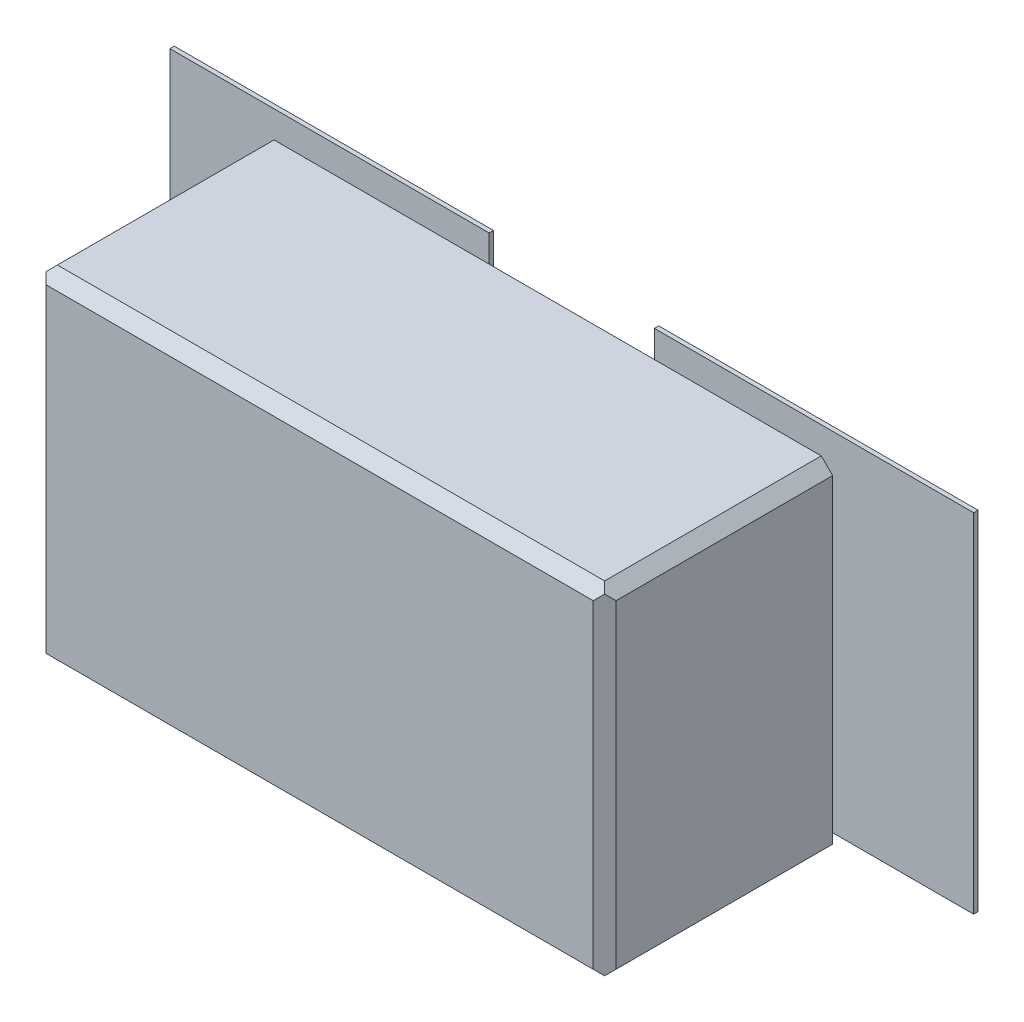
ISO-10303-21;
HEADER;
FILE_DESCRIPTION(('STEP AP214'),'2;1');
FILE_NAME('part.step','',(''),(''),'','','');
FILE_SCHEMA(('AUTOMOTIVE_DESIGN { 1 0 10303 214 1 1 1 1 }'));
ENDSEC;
DATA;
#1=APPLICATION_CONTEXT('core data for automotive mechanical design processes');
#2=APPLICATION_PROTOCOL_DEFINITION('international standard','automotive_design',2000,#1);
#3=PRODUCT_CONTEXT('',#1,'mechanical');
#4=PRODUCT('Part','Part','',(#3));
#5=PRODUCT_RELATED_PRODUCT_CATEGORY('part','',(#4));
#6=PRODUCT_DEFINITION_FORMATION('','',#4);
#7=PRODUCT_DEFINITION_CONTEXT('part definition',#1,'design');
#8=PRODUCT_DEFINITION('design','',#6,#7);
#9=PRODUCT_DEFINITION_SHAPE('','',#8);
#10=(LENGTH_UNIT() NAMED_UNIT(*) SI_UNIT(.MILLI.,.METRE.));
#11=(NAMED_UNIT(*) PLANE_ANGLE_UNIT() SI_UNIT($,.RADIAN.));
#12=(NAMED_UNIT(*) SI_UNIT($,.STERADIAN.) SOLID_ANGLE_UNIT());
#13=UNCERTAINTY_MEASURE_WITH_UNIT(LENGTH_MEASURE(1.E-05),#10,'distance_accuracy_value','');
#14=(GEOMETRIC_REPRESENTATION_CONTEXT(3) GLOBAL_UNCERTAINTY_ASSIGNED_CONTEXT((#13)) GLOBAL_UNIT_ASSIGNED_CONTEXT((#10,
#11,#12)) REPRESENTATION_CONTEXT('',''));
#15=CARTESIAN_POINT('',(0.,0.,0.));
#16=DIRECTION('',(0.,0.,1.));
#17=DIRECTION('',(1.,0.,0.));
#18=AXIS2_PLACEMENT_3D('',#15,#16,#17);
#19=CARTESIAN_POINT('',(-0.49,0.,0.5162));
#20=DIRECTION('',(-0.707106781186548,0.,0.707106781186548));
#21=DIRECTION('',(0.,1.,0.));
#22=AXIS2_PLACEMENT_3D('',#19,#20,#21);
#23=PLANE('',#22);
#24=DIRECTION('',(0.,-1.,0.));
#25=VECTOR('',#24,1.);
#26=CARTESIAN_POINT('',(-0.5,0.28,0.5062));
#27=LINE('',#26,#25);
#28=CARTESIAN_POINT('',(-0.5,0.28,0.5062));
#29=VERTEX_POINT('',#28);
#30=CARTESIAN_POINT('',(-0.5,-0.28,0.5062));
#31=VERTEX_POINT('',#30);
#32=EDGE_CURVE('P0_E265',#29,#31,#27,.T.);
#33=ORIENTED_EDGE('',*,*,#32,.T.);
#34=DIRECTION('',(-0.577350269189626,0.577350269189626,-0.577350269189626));
#35=VECTOR('',#34,1.);
#36=CARTESIAN_POINT('',(-0.49,-0.29,0.5162));
#37=LINE('',#36,#35);
#38=CARTESIAN_POINT('',(-0.49,-0.29,0.5162));
#39=VERTEX_POINT('',#38);
#40=EDGE_CURVE('P0_E332',#39,#31,#37,.T.);
#41=ORIENTED_EDGE('',*,*,#40,.F.);
#42=DIRECTION('',(-0.577350269189626,-0.577350269189626,-0.577350269189626));
#43=VECTOR('',#42,1.);
#44=CARTESIAN_POINT('',(-0.48,-0.28,0.5262));
#45=LINE('',#44,#43);
#46=CARTESIAN_POINT('',(-0.48,-0.28,0.5262));
#47=VERTEX_POINT('',#46);
#48=EDGE_CURVE('P0_E11',#47,#39,#45,.T.);
#49=ORIENTED_EDGE('',*,*,#48,.F.);
#50=DIRECTION('',(0.,-1.,0.));
#51=VECTOR('',#50,1.);
#52=CARTESIAN_POINT('',(-0.48,0.28,0.5262));
#53=LINE('',#52,#51);
#54=CARTESIAN_POINT('',(-0.48,0.28,0.5262));
#55=VERTEX_POINT('',#54);
#56=EDGE_CURVE('P0_E307',#55,#47,#53,.T.);
#57=ORIENTED_EDGE('',*,*,#56,.F.);
#58=DIRECTION('',(0.577350269189626,-0.577350269189626,0.577350269189626));
#59=VECTOR('',#58,1.);
#60=CARTESIAN_POINT('',(-0.49,0.29,0.5162));
#61=LINE('',#60,#59);
#62=CARTESIAN_POINT('',(-0.49,0.29,0.5162));
#63=VERTEX_POINT('',#62);
#64=EDGE_CURVE('P0_E308',#63,#55,#61,.T.);
#65=ORIENTED_EDGE('',*,*,#64,.F.);
#66=DIRECTION('',(0.577350269189626,0.577350269189626,0.577350269189626));
#67=VECTOR('',#66,1.);
#68=CARTESIAN_POINT('',(-0.5,0.28,0.5062));
#69=LINE('',#68,#67);
#70=EDGE_CURVE('P0_E264',#29,#63,#69,.T.);
#71=ORIENTED_EDGE('',*,*,#70,.F.);
#72=EDGE_LOOP('',(#33,#41,#49,#57,#65,#71));
#73=FACE_BOUND('',#72,.T.);
#74=ADVANCED_FACE('P0_F16',(#73),#23,.T.);
#75=CARTESIAN_POINT('',(0.,-0.29,0.5162));
#76=DIRECTION('',(0.,-0.707106781186548,0.707106781186548));
#77=DIRECTION('',(-1.,0.,0.));
#78=AXIS2_PLACEMENT_3D('',#75,#76,#77);
#79=PLANE('',#78);
#80=DIRECTION('',(1.,0.,0.));
#81=VECTOR('',#80,1.);
#82=CARTESIAN_POINT('',(-0.48,-0.3,0.5062));
#83=LINE('',#82,#81);
#84=CARTESIAN_POINT('',(-0.48,-0.3,0.5062));
#85=VERTEX_POINT('',#84);
#86=CARTESIAN_POINT('',(0.48,-0.3,0.5062));
#87=VERTEX_POINT('',#86);
#88=EDGE_CURVE('P0_E254',#85,#87,#83,.T.);
#89=ORIENTED_EDGE('',*,*,#88,.T.);
#90=DIRECTION('',(-0.577350269189626,-0.577350269189626,-0.577350269189626));
#91=VECTOR('',#90,1.);
#92=CARTESIAN_POINT('',(0.49,-0.29,0.5162));
#93=LINE('',#92,#91);
#94=CARTESIAN_POINT('',(0.49,-0.29,0.5162));
#95=VERTEX_POINT('',#94);
#96=EDGE_CURVE('P0_E220',#95,#87,#93,.T.);
#97=ORIENTED_EDGE('',*,*,#96,.F.);
#98=DIRECTION('',(0.577350269189626,-0.577350269189626,-0.577350269189626));
#99=VECTOR('',#98,1.);
#100=CARTESIAN_POINT('',(0.48,-0.28,0.5262));
#101=LINE('',#100,#99);
#102=CARTESIAN_POINT('',(0.48,-0.28,0.5262));
#103=VERTEX_POINT('',#102);
#104=EDGE_CURVE('P0_E27',#103,#95,#101,.T.);
#105=ORIENTED_EDGE('',*,*,#104,.F.);
#106=DIRECTION('',(1.,0.,0.));
#107=VECTOR('',#106,1.);
#108=CARTESIAN_POINT('',(-0.48,-0.28,0.5262));
#109=LINE('',#108,#107);
#110=EDGE_CURVE('P0_E326',#47,#103,#109,.T.);
#111=ORIENTED_EDGE('',*,*,#110,.F.);
#112=ORIENTED_EDGE('',*,*,#48,.T.);
#113=DIRECTION('',(-0.577350269189626,0.577350269189626,0.577350269189626));
#114=VECTOR('',#113,1.);
#115=CARTESIAN_POINT('',(-0.48,-0.3,0.5062));
#116=LINE('',#115,#114);
#117=EDGE_CURVE('P0_E337',#85,#39,#116,.T.);
#118=ORIENTED_EDGE('',*,*,#117,.F.);
#119=EDGE_LOOP('',(#89,#97,#105,#111,#112,#118));
#120=FACE_BOUND('',#119,.T.);
#121=ADVANCED_FACE('P0_F530',(#120),#79,.T.);
#122=CARTESIAN_POINT('',(0.49,0.,0.5162));
#123=DIRECTION('',(0.707106781186548,0.,0.707106781186548));
#124=DIRECTION('',(0.,-1.,0.));
#125=AXIS2_PLACEMENT_3D('',#122,#123,#124);
#126=PLANE('',#125);
#127=DIRECTION('',(0.,1.,0.));
#128=VECTOR('',#127,1.);
#129=CARTESIAN_POINT('',(0.5,-0.28,0.5062));
#130=LINE('',#129,#128);
#131=CARTESIAN_POINT('',(0.5,-0.28,0.5062));
#132=VERTEX_POINT('',#131);
#133=CARTESIAN_POINT('',(0.5,0.28,0.5062));
#134=VERTEX_POINT('',#133);
#135=EDGE_CURVE('P0_E213',#132,#134,#130,.T.);
#136=ORIENTED_EDGE('',*,*,#135,.T.);
#137=DIRECTION('',(0.577350269189626,-0.577350269189626,-0.577350269189626));
#138=VECTOR('',#137,1.);
#139=CARTESIAN_POINT('',(0.49,0.29,0.5162));
#140=LINE('',#139,#138);
#141=CARTESIAN_POINT('',(0.49,0.29,0.5162));
#142=VERTEX_POINT('',#141);
#143=EDGE_CURVE('P0_E241',#142,#134,#140,.T.);
#144=ORIENTED_EDGE('',*,*,#143,.F.);
#145=DIRECTION('',(0.577350269189626,0.577350269189626,-0.577350269189626));
#146=VECTOR('',#145,1.);
#147=CARTESIAN_POINT('',(0.48,0.28,0.5262));
#148=LINE('',#147,#146);
#149=CARTESIAN_POINT('',(0.48,0.28,0.5262));
#150=VERTEX_POINT('',#149);
#151=EDGE_CURVE('P0_E259',#150,#142,#148,.T.);
#152=ORIENTED_EDGE('',*,*,#151,.F.);
#153=DIRECTION('',(0.,1.,0.));
#154=VECTOR('',#153,1.);
#155=CARTESIAN_POINT('',(0.48,-0.28,0.5262));
#156=LINE('',#155,#154);
#157=EDGE_CURVE('P0_E305',#103,#150,#156,.T.);
#158=ORIENTED_EDGE('',*,*,#157,.F.);
#159=ORIENTED_EDGE('',*,*,#104,.T.);
#160=DIRECTION('',(-0.577350269189626,-0.577350269189626,0.577350269189626));
#161=VECTOR('',#160,1.);
#162=CARTESIAN_POINT('',(0.5,-0.28,0.5062));
#163=LINE('',#162,#161);
#164=EDGE_CURVE('P0_E208',#132,#95,#163,.T.);
#165=ORIENTED_EDGE('',*,*,#164,.F.);
#166=EDGE_LOOP('',(#136,#144,#152,#158,#159,#165));
#167=FACE_BOUND('',#166,.T.);
#168=ADVANCED_FACE('P0_F210',(#167),#126,.T.);
#169=CARTESIAN_POINT('',(0.,0.,0.5262));
#170=DIRECTION('',(0.,0.,1.));
#171=DIRECTION('',(1.,0.,0.));
#172=AXIS2_PLACEMENT_3D('',#169,#170,#171);
#173=PLANE('',#172);
#174=ORIENTED_EDGE('',*,*,#157,.T.);
#175=DIRECTION('',(-1.,0.,0.));
#176=VECTOR('',#175,1.);
#177=CARTESIAN_POINT('',(0.48,0.28,0.5262));
#178=LINE('',#177,#176);
#179=EDGE_CURVE('P0_E255',#150,#55,#178,.T.);
#180=ORIENTED_EDGE('',*,*,#179,.T.);
#181=ORIENTED_EDGE('',*,*,#56,.T.);
#182=ORIENTED_EDGE('',*,*,#110,.T.);
#183=EDGE_LOOP('',(#174,#180,#181,#182));
#184=FACE_BOUND('',#183,.T.);
#185=ADVANCED_FACE('P0_F487',(#184),#173,.T.);
#186=CARTESIAN_POINT('',(0.,0.29,0.5162));
#187=DIRECTION('',(0.,0.707106781186548,0.707106781186548));
#188=DIRECTION('',(1.,0.,0.));
#189=AXIS2_PLACEMENT_3D('',#186,#187,#188);
#190=PLANE('',#189);
#191=ORIENTED_EDGE('',*,*,#179,.F.);
#192=ORIENTED_EDGE('',*,*,#151,.T.);
#193=DIRECTION('',(0.577350269189626,-0.577350269189626,0.577350269189626));
#194=VECTOR('',#193,1.);
#195=CARTESIAN_POINT('',(0.48,0.3,0.5062));
#196=LINE('',#195,#194);
#197=CARTESIAN_POINT('',(0.48,0.3,0.5062));
#198=VERTEX_POINT('',#197);
#199=EDGE_CURVE('P0_E274',#198,#142,#196,.T.);
#200=ORIENTED_EDGE('',*,*,#199,.F.);
#201=DIRECTION('',(-1.,0.,0.));
#202=VECTOR('',#201,1.);
#203=CARTESIAN_POINT('',(0.48,0.3,0.5062));
#204=LINE('',#203,#202);
#205=CARTESIAN_POINT('',(-0.48,0.3,0.5062));
#206=VERTEX_POINT('',#205);
#207=EDGE_CURVE('P0_E260',#198,#206,#204,.T.);
#208=ORIENTED_EDGE('',*,*,#207,.T.);
#209=DIRECTION('',(-0.577350269189626,-0.577350269189626,0.577350269189626));
#210=VECTOR('',#209,1.);
#211=CARTESIAN_POINT('',(-0.48,0.3,0.5062));
#212=LINE('',#211,#210);
#213=EDGE_CURVE('P0_E317',#206,#63,#212,.T.);
#214=ORIENTED_EDGE('',*,*,#213,.T.);
#215=ORIENTED_EDGE('',*,*,#64,.T.);
#216=EDGE_LOOP('',(#191,#192,#200,#208,#214,#215));
#217=FACE_BOUND('',#216,.T.);
#218=ADVANCED_FACE('P0_F484',(#217),#190,.T.);
#219=CARTESIAN_POINT('',(0.5,0.3,0.0762));
#220=DIRECTION('',(0.,1.,0.));
#221=DIRECTION('',(1.,0.,0.));
#222=AXIS2_PLACEMENT_3D('',#219,#220,#221);
#223=PLANE('',#222);
#224=DIRECTION('',(0.,0.,-1.));
#225=VECTOR('',#224,1.);
#226=CARTESIAN_POINT('',(0.48,0.3,0.5062));
#227=LINE('',#226,#225);
#228=CARTESIAN_POINT('',(0.48,0.3,0.1262));
#229=VERTEX_POINT('',#228);
#230=EDGE_CURVE('P0_E271',#198,#229,#227,.T.);
#231=ORIENTED_EDGE('',*,*,#230,.T.);
#232=DIRECTION('',(-1.,0.,0.));
#233=VECTOR('',#232,1.);
#234=CARTESIAN_POINT('',(0.48,0.3,0.1262));
#235=LINE('',#234,#233);
#236=CARTESIAN_POINT('',(-0.48,0.3,0.1262));
#237=VERTEX_POINT('',#236);
#238=EDGE_CURVE('P0_E250',#229,#237,#235,.T.);
#239=ORIENTED_EDGE('',*,*,#238,.T.);
#240=DIRECTION('',(0.,0.,-1.));
#241=VECTOR('',#240,1.);
#242=CARTESIAN_POINT('',(-0.48,0.3,0.5062));
#243=LINE('',#242,#241);
#244=EDGE_CURVE('P0_E159',#206,#237,#243,.T.);
#245=ORIENTED_EDGE('',*,*,#244,.F.);
#246=ORIENTED_EDGE('',*,*,#207,.F.);
#247=EDGE_LOOP('',(#231,#239,#245,#246));
#248=FACE_BOUND('',#247,.T.);
#249=ADVANCED_FACE('P0_F655',(#248),#223,.T.);
#250=CARTESIAN_POINT('',(-0.49,0.29,0.3262));
#251=DIRECTION('',(-0.707106781186548,0.707106781186548,0.));
#252=DIRECTION('',(0.,0.,1.));
#253=AXIS2_PLACEMENT_3D('',#250,#251,#252);
#254=PLANE('',#253);
#255=DIRECTION('',(0.707106781186548,0.707106781186548,0.));
#256=VECTOR('',#255,1.);
#257=CARTESIAN_POINT('',(-0.5,0.28,0.1262));
#258=LINE('',#257,#256);
#259=CARTESIAN_POINT('',(-0.5,0.28,0.1262));
#260=VERTEX_POINT('',#259);
#261=EDGE_CURVE('P0_E266',#260,#237,#258,.T.);
#262=ORIENTED_EDGE('',*,*,#261,.F.);
#263=DIRECTION('',(0.,0.,-1.));
#264=VECTOR('',#263,1.);
#265=CARTESIAN_POINT('',(-0.5,0.28,0.5062));
#266=LINE('',#265,#264);
#267=EDGE_CURVE('P0_E261',#29,#260,#266,.T.);
#268=ORIENTED_EDGE('',*,*,#267,.F.);
#269=ORIENTED_EDGE('',*,*,#70,.T.);
#270=ORIENTED_EDGE('',*,*,#213,.F.);
#271=ORIENTED_EDGE('',*,*,#244,.T.);
#272=EDGE_LOOP('',(#262,#268,#269,#270,#271));
#273=FACE_BOUND('',#272,.T.);
#274=ADVANCED_FACE('P0_F554',(#273),#254,.T.);
#275=CARTESIAN_POINT('',(-0.5,0.3,0.0762));
#276=DIRECTION('',(-1.,0.,0.));
#277=DIRECTION('',(0.,0.,1.));
#278=AXIS2_PLACEMENT_3D('',#275,#276,#277);
#279=PLANE('',#278);
#280=DIRECTION('',(0.,0.,-1.));
#281=VECTOR('',#280,1.);
#282=CARTESIAN_POINT('',(-0.5,-0.28,0.5062));
#283=LINE('',#282,#281);
#284=CARTESIAN_POINT('',(-0.5,-0.28,0.1262));
#285=VERTEX_POINT('',#284);
#286=EDGE_CURVE('P0_E336',#31,#285,#283,.T.);
#287=ORIENTED_EDGE('',*,*,#286,.F.);
#288=ORIENTED_EDGE('',*,*,#32,.F.);
#289=ORIENTED_EDGE('',*,*,#267,.T.);
#290=DIRECTION('',(0.,-1.,0.));
#291=VECTOR('',#290,1.);
#292=CARTESIAN_POINT('',(-0.5,0.28,0.1262));
#293=LINE('',#292,#291);
#294=EDGE_CURVE('P0_E270',#260,#285,#293,.T.);
#295=ORIENTED_EDGE('',*,*,#294,.T.);
#296=EDGE_LOOP('',(#287,#288,#289,#295));
#297=FACE_BOUND('',#296,.T.);
#298=ADVANCED_FACE('P0_F551',(#297),#279,.T.);
#299=CARTESIAN_POINT('',(-0.49,-0.29,0.3262));
#300=DIRECTION('',(-0.707106781186548,-0.707106781186548,0.));
#301=DIRECTION('',(-0.707106781186548,0.707106781186548,0.));
#302=AXIS2_PLACEMENT_3D('',#299,#300,#301);
#303=PLANE('',#302);
#304=DIRECTION('',(-0.707106781186548,0.707106781186548,0.));
#305=VECTOR('',#304,1.);
#306=CARTESIAN_POINT('',(-0.48,-0.3,0.1262));
#307=LINE('',#306,#305);
#308=CARTESIAN_POINT('',(-0.48,-0.3,0.1262));
#309=VERTEX_POINT('',#308);
#310=EDGE_CURVE('P0_E301',#309,#285,#307,.T.);
#311=ORIENTED_EDGE('',*,*,#310,.F.);
#312=DIRECTION('',(0.,0.,-1.));
#313=VECTOR('',#312,1.);
#314=CARTESIAN_POINT('',(-0.48,-0.3,0.5062));
#315=LINE('',#314,#313);
#316=EDGE_CURVE('P0_E321',#85,#309,#315,.T.);
#317=ORIENTED_EDGE('',*,*,#316,.F.);
#318=ORIENTED_EDGE('',*,*,#117,.T.);
#319=ORIENTED_EDGE('',*,*,#40,.T.);
#320=ORIENTED_EDGE('',*,*,#286,.T.);
#321=EDGE_LOOP('',(#311,#317,#318,#319,#320));
#322=FACE_BOUND('',#321,.T.);
#323=ADVANCED_FACE('P0_F471',(#322),#303,.T.);
#324=CARTESIAN_POINT('',(-0.5,-0.3,0.0762));
#325=DIRECTION('',(0.,-1.,0.));
#326=DIRECTION('',(0.,0.,-1.));
#327=AXIS2_PLACEMENT_3D('',#324,#325,#326);
#328=PLANE('',#327);
#329=DIRECTION('',(0.,0.,-1.));
#330=VECTOR('',#329,1.);
#331=CARTESIAN_POINT('',(0.48,-0.3,0.5062));
#332=LINE('',#331,#330);
#333=CARTESIAN_POINT('',(0.48,-0.3,0.1262));
#334=VERTEX_POINT('',#333);
#335=EDGE_CURVE('P0_E251',#87,#334,#332,.T.);
#336=ORIENTED_EDGE('',*,*,#335,.F.);
#337=ORIENTED_EDGE('',*,*,#88,.F.);
#338=ORIENTED_EDGE('',*,*,#316,.T.);
#339=DIRECTION('',(1.,0.,0.));
#340=VECTOR('',#339,1.);
#341=CARTESIAN_POINT('',(-0.48,-0.3,0.1262));
#342=LINE('',#341,#340);
#343=EDGE_CURVE('P0_E293',#309,#334,#342,.T.);
#344=ORIENTED_EDGE('',*,*,#343,.T.);
#345=EDGE_LOOP('',(#336,#337,#338,#344));
#346=FACE_BOUND('',#345,.T.);
#347=ADVANCED_FACE('P0_F467',(#346),#328,.T.);
#348=CARTESIAN_POINT('',(0.49,-0.29,0.3262));
#349=DIRECTION('',(0.707106781186548,-0.707106781186548,0.));
#350=DIRECTION('',(0.,0.,-1.));
#351=AXIS2_PLACEMENT_3D('',#348,#349,#350);
#352=PLANE('',#351);
#353=DIRECTION('',(-0.707106781186548,-0.707106781186548,0.));
#354=VECTOR('',#353,1.);
#355=CARTESIAN_POINT('',(0.5,-0.28,0.1262));
#356=LINE('',#355,#354);
#357=CARTESIAN_POINT('',(0.5,-0.28,0.1262));
#358=VERTEX_POINT('',#357);
#359=EDGE_CURVE('P0_E226',#358,#334,#356,.T.);
#360=ORIENTED_EDGE('',*,*,#359,.F.);
#361=DIRECTION('',(0.,0.,-1.));
#362=VECTOR('',#361,1.);
#363=CARTESIAN_POINT('',(0.5,-0.28,0.5062));
#364=LINE('',#363,#362);
#365=EDGE_CURVE('P0_E221',#132,#358,#364,.T.);
#366=ORIENTED_EDGE('',*,*,#365,.F.);
#367=ORIENTED_EDGE('',*,*,#164,.T.);
#368=ORIENTED_EDGE('',*,*,#96,.T.);
#369=ORIENTED_EDGE('',*,*,#335,.T.);
#370=EDGE_LOOP('',(#360,#366,#367,#368,#369));
#371=FACE_BOUND('',#370,.T.);
#372=ADVANCED_FACE('P0_F224',(#371),#352,.T.);
#373=CARTESIAN_POINT('',(0.5,-0.3,0.0762));
#374=DIRECTION('',(1.,0.,0.));
#375=DIRECTION('',(0.,1.,0.));
#376=AXIS2_PLACEMENT_3D('',#373,#374,#375);
#377=PLANE('',#376);
#378=DIRECTION('',(0.,0.,-1.));
#379=VECTOR('',#378,1.);
#380=CARTESIAN_POINT('',(0.5,0.28,0.5062));
#381=LINE('',#380,#379);
#382=CARTESIAN_POINT('',(0.5,0.28,0.1262));
#383=VERTEX_POINT('',#382);
#384=EDGE_CURVE('P0_E233',#134,#383,#381,.T.);
#385=ORIENTED_EDGE('',*,*,#384,.F.);
#386=ORIENTED_EDGE('',*,*,#135,.F.);
#387=ORIENTED_EDGE('',*,*,#365,.T.);
#388=DIRECTION('',(0.,1.,0.));
#389=VECTOR('',#388,1.);
#390=CARTESIAN_POINT('',(0.5,-0.28,0.1262));
#391=LINE('',#390,#389);
#392=EDGE_CURVE('P0_E294',#358,#383,#391,.T.);
#393=ORIENTED_EDGE('',*,*,#392,.T.);
#394=EDGE_LOOP('',(#385,#386,#387,#393));
#395=FACE_BOUND('',#394,.T.);
#396=ADVANCED_FACE('P0_F232',(#395),#377,.T.);
#397=CARTESIAN_POINT('',(0.49,0.29,0.3262));
#398=DIRECTION('',(0.707106781186548,0.707106781186548,0.));
#399=DIRECTION('',(0.,0.,-1.));
#400=AXIS2_PLACEMENT_3D('',#397,#398,#399);
#401=PLANE('',#400);
#402=DIRECTION('',(0.707106781186548,-0.707106781186548,0.));
#403=VECTOR('',#402,1.);
#404=CARTESIAN_POINT('',(0.48,0.3,0.1262));
#405=LINE('',#404,#403);
#406=EDGE_CURVE('P0_E20',#229,#383,#405,.T.);
#407=ORIENTED_EDGE('',*,*,#406,.F.);
#408=ORIENTED_EDGE('',*,*,#230,.F.);
#409=ORIENTED_EDGE('',*,*,#199,.T.);
#410=ORIENTED_EDGE('',*,*,#143,.T.);
#411=ORIENTED_EDGE('',*,*,#384,.T.);
#412=EDGE_LOOP('',(#407,#408,#409,#410,#411));
#413=FACE_BOUND('',#412,.T.);
#414=ADVANCED_FACE('P0_F479',(#413),#401,.T.);
#415=CARTESIAN_POINT('',(-0.4659973957868,-0.25,0.1262));
#416=DIRECTION('',(-1.,0.,0.));
#417=DIRECTION('',(0.,0.,1.));
#418=AXIS2_PLACEMENT_3D('',#415,#416,#417);
#419=PLANE('',#418);
#420=DIRECTION('',(0.,1.,0.));
#421=VECTOR('',#420,1.);
#422=CARTESIAN_POINT('',(-0.4659973957868,-0.25,0.1262));
#423=LINE('',#422,#421);
#424=CARTESIAN_POINT('',(-0.4659973957868,-0.25,0.1262));
#425=VERTEX_POINT('',#424);
#426=CARTESIAN_POINT('',(-0.4659973957868,0.2,0.1262));
#427=VERTEX_POINT('',#426);
#428=EDGE_CURVE('P0_E79',#425,#427,#423,.T.);
#429=ORIENTED_EDGE('',*,*,#428,.T.);
#430=DIRECTION('',(0.,0.,-1.));
#431=VECTOR('',#430,1.);
#432=CARTESIAN_POINT('',(-0.4659973957868,0.2,0.1262));
#433=LINE('',#432,#431);
#434=CARTESIAN_POINT('',(-0.4659973957868,0.2,0.0862));
#435=VERTEX_POINT('',#434);
#436=EDGE_CURVE('P0_E275',#427,#435,#433,.T.);
#437=ORIENTED_EDGE('',*,*,#436,.T.);
#438=DIRECTION('',(0.,1.,0.));
#439=VECTOR('',#438,1.);
#440=CARTESIAN_POINT('',(-0.4659973957868,-0.25,0.0862));
#441=LINE('',#440,#439);
#442=CARTESIAN_POINT('',(-0.4659973957868,-0.25,0.0862));
#443=VERTEX_POINT('',#442);
#444=EDGE_CURVE('P0_E91',#443,#435,#441,.T.);
#445=ORIENTED_EDGE('',*,*,#444,.F.);
#446=DIRECTION('',(0.,0.,-1.));
#447=VECTOR('',#446,1.);
#448=CARTESIAN_POINT('',(-0.4659973957868,-0.25,0.1262));
#449=LINE('',#448,#447);
#450=EDGE_CURVE('P0_E342',#425,#443,#449,.T.);
#451=ORIENTED_EDGE('',*,*,#450,.F.);
#452=EDGE_LOOP('',(#429,#437,#445,#451));
#453=FACE_BOUND('',#452,.T.);
#454=ADVANCED_FACE('P0_F418',(#453),#419,.T.);
#455=CARTESIAN_POINT('',(-0.4659973957868,0.25,0.1262));
#456=DIRECTION('',(0.,0.,-1.));
#457=DIRECTION('',(-1.,0.,0.));
#458=AXIS2_PLACEMENT_3D('',#455,#456,#457);
#459=CYLINDRICAL_SURFACE('',#458,0.05);
#460=CARTESIAN_POINT('',(-0.4659973957868,0.25,0.1262));
#461=DIRECTION('',(0.,0.,-1.));
#462=DIRECTION('',(1.,0.,0.));
#463=AXIS2_PLACEMENT_3D('',#460,#461,#462);
#464=CIRCLE('',#463,0.05);
#465=CARTESIAN_POINT('',(-0.4159973957868,0.25,0.1262));
#466=VERTEX_POINT('',#465);
#467=EDGE_CURVE('P0_E396',#466,#427,#464,.T.);
#468=ORIENTED_EDGE('',*,*,#467,.F.);
#469=DIRECTION('',(0.,0.,-1.));
#470=VECTOR('',#469,1.);
#471=CARTESIAN_POINT('',(-0.4159973957868,0.25,0.1262));
#472=LINE('',#471,#470);
#473=CARTESIAN_POINT('',(-0.4159973957868,0.25,0.0862));
#474=VERTEX_POINT('',#473);
#475=EDGE_CURVE('P0_E282',#466,#474,#472,.T.);
#476=ORIENTED_EDGE('',*,*,#475,.T.);
#477=CARTESIAN_POINT('',(-0.4659973957868,0.25,0.0862));
#478=DIRECTION('',(0.,0.,1.));
#479=DIRECTION('',(0.,-1.,0.));
#480=AXIS2_PLACEMENT_3D('',#477,#478,#479);
#481=CIRCLE('',#480,0.05);
#482=EDGE_CURVE('P0_E245',#435,#474,#481,.T.);
#483=ORIENTED_EDGE('',*,*,#482,.F.);
#484=ORIENTED_EDGE('',*,*,#436,.F.);
#485=EDGE_LOOP('',(#468,#476,#483,#484));
#486=FACE_BOUND('',#485,.T.);
#487=ADVANCED_FACE('P0_F422',(#486),#459,.F.);
#488=CARTESIAN_POINT('',(-0.4159973957868,0.25,0.1262));
#489=DIRECTION('',(0.,1.,0.));
#490=DIRECTION('',(1.,0.,0.));
#491=AXIS2_PLACEMENT_3D('',#488,#489,#490);
#492=PLANE('',#491);
#493=DIRECTION('',(1.,0.,0.));
#494=VECTOR('',#493,1.);
#495=CARTESIAN_POINT('',(-0.4159973957868,0.25,0.1262));
#496=LINE('',#495,#494);
#497=CARTESIAN_POINT('',(-0.2159973957868,0.25,0.1262));
#498=VERTEX_POINT('',#497);
#499=EDGE_CURVE('P0_E249',#466,#498,#496,.T.);
#500=ORIENTED_EDGE('',*,*,#499,.T.);
#501=DIRECTION('',(0.,0.,-1.));
#502=VECTOR('',#501,1.);
#503=CARTESIAN_POINT('',(-0.2159973957868,0.25,0.1262));
#504=LINE('',#503,#502);
#505=CARTESIAN_POINT('',(-0.2159973957868,0.25,0.0862));
#506=VERTEX_POINT('',#505);
#507=EDGE_CURVE('P0_E146',#498,#506,#504,.T.);
#508=ORIENTED_EDGE('',*,*,#507,.T.);
#509=DIRECTION('',(1.,0.,0.));
#510=VECTOR('',#509,1.);
#511=CARTESIAN_POINT('',(-0.4159973957868,0.25,0.0862));
#512=LINE('',#511,#510);
#513=EDGE_CURVE('P0_E353',#474,#506,#512,.T.);
#514=ORIENTED_EDGE('',*,*,#513,.F.);
#515=ORIENTED_EDGE('',*,*,#475,.F.);
#516=EDGE_LOOP('',(#500,#508,#514,#515));
#517=FACE_BOUND('',#516,.T.);
#518=ADVANCED_FACE('P0_F580',(#517),#492,.T.);
#519=CARTESIAN_POINT('',(-0.2159973957868,0.25,0.1262));
#520=DIRECTION('',(1.,0.,0.));
#521=DIRECTION('',(0.,1.,0.));
#522=AXIS2_PLACEMENT_3D('',#519,#520,#521);
#523=PLANE('',#522);
#524=DIRECTION('',(0.,-1.,0.));
#525=VECTOR('',#524,1.);
#526=CARTESIAN_POINT('',(-0.2159973957868,0.25,0.1262));
#527=LINE('',#526,#525);
#528=CARTESIAN_POINT('',(-0.2159973957868,-0.25,0.1262));
#529=VERTEX_POINT('',#528);
#530=EDGE_CURVE('P0_E247',#498,#529,#527,.T.);
#531=ORIENTED_EDGE('',*,*,#530,.T.);
#532=DIRECTION('',(0.,0.,-1.));
#533=VECTOR('',#532,1.);
#534=CARTESIAN_POINT('',(-0.2159973957868,-0.25,0.1262));
#535=LINE('',#534,#533);
#536=CARTESIAN_POINT('',(-0.2159973957868,-0.25,0.0862));
#537=VERTEX_POINT('',#536);
#538=EDGE_CURVE('P0_E352',#529,#537,#535,.T.);
#539=ORIENTED_EDGE('',*,*,#538,.T.);
#540=DIRECTION('',(0.,-1.,0.));
#541=VECTOR('',#540,1.);
#542=CARTESIAN_POINT('',(-0.2159973957868,0.25,0.0862));
#543=LINE('',#542,#541);
#544=EDGE_CURVE('P0_E304',#506,#537,#543,.T.);
#545=ORIENTED_EDGE('',*,*,#544,.F.);
#546=ORIENTED_EDGE('',*,*,#507,.F.);
#547=EDGE_LOOP('',(#531,#539,#545,#546));
#548=FACE_BOUND('',#547,.T.);
#549=ADVANCED_FACE('P0_F429',(#548),#523,.T.);
#550=CARTESIAN_POINT('',(0.,0.,0.0862));
#551=DIRECTION('',(0.,0.,-1.));
#552=DIRECTION('',(0.,-1.,0.));
#553=AXIS2_PLACEMENT_3D('',#550,#551,#552);
#554=PLANE('',#553);
#555=ORIENTED_EDGE('',*,*,#544,.T.);
#556=DIRECTION('',(-1.,0.,0.));
#557=VECTOR('',#556,1.);
#558=CARTESIAN_POINT('',(-0.2159973957868,-0.25,0.0862));
#559=LINE('',#558,#557);
#560=EDGE_CURVE('P0_E349',#537,#443,#559,.T.);
#561=ORIENTED_EDGE('',*,*,#560,.T.);
#562=ORIENTED_EDGE('',*,*,#444,.T.);
#563=ORIENTED_EDGE('',*,*,#482,.T.);
#564=ORIENTED_EDGE('',*,*,#513,.T.);
#565=EDGE_LOOP('',(#555,#561,#562,#563,#564));
#566=FACE_BOUND('',#565,.T.);
#567=ADVANCED_FACE('P0_F425',(#566),#554,.T.);
#568=CARTESIAN_POINT('',(0.,0.,0.0862));
#569=DIRECTION('',(0.,0.,-1.));
#570=DIRECTION('',(0.,-1.,0.));
#571=AXIS2_PLACEMENT_3D('',#568,#569,#570);
#572=PLANE('',#571);
#573=DIRECTION('',(0.,-1.,0.));
#574=VECTOR('',#573,1.);
#575=CARTESIAN_POINT('',(0.4340026042132,0.25,0.0862));
#576=LINE('',#575,#574);
#577=CARTESIAN_POINT('',(0.4340026042132,0.25,0.0862));
#578=VERTEX_POINT('',#577);
#579=CARTESIAN_POINT('',(0.4340026042132,-0.25,0.0862));
#580=VERTEX_POINT('',#579);
#581=EDGE_CURVE('P0_E373',#578,#580,#576,.T.);
#582=ORIENTED_EDGE('',*,*,#581,.T.);
#583=DIRECTION('',(-1.,0.,0.));
#584=VECTOR('',#583,1.);
#585=CARTESIAN_POINT('',(0.4340026042132,-0.25,0.0862));
#586=LINE('',#585,#584);
#587=CARTESIAN_POINT('',(0.1840026042132,-0.25,0.0862));
#588=VERTEX_POINT('',#587);
#589=EDGE_CURVE('P0_E280',#580,#588,#586,.T.);
#590=ORIENTED_EDGE('',*,*,#589,.T.);
#591=DIRECTION('',(0.,1.,0.));
#592=VECTOR('',#591,1.);
#593=CARTESIAN_POINT('',(0.1840026042132,-0.25,0.0862));
#594=LINE('',#593,#592);
#595=CARTESIAN_POINT('',(0.1840026042132,0.25,0.0862));
#596=VERTEX_POINT('',#595);
#597=EDGE_CURVE('P0_E281',#588,#596,#594,.T.);
#598=ORIENTED_EDGE('',*,*,#597,.T.);
#599=DIRECTION('',(1.,0.,0.));
#600=VECTOR('',#599,1.);
#601=CARTESIAN_POINT('',(0.1840026042132,0.25,0.0862));
#602=LINE('',#601,#600);
#603=EDGE_CURVE('P0_E286',#596,#578,#602,.T.);
#604=ORIENTED_EDGE('',*,*,#603,.T.);
#605=EDGE_LOOP('',(#582,#590,#598,#604));
#606=FACE_BOUND('',#605,.T.);
#607=ADVANCED_FACE('P0_F500',(#606),#572,.T.);
#608=CARTESIAN_POINT('',(0.4340026042132,-0.25,0.1262));
#609=DIRECTION('',(0.,-1.,0.));
#610=DIRECTION('',(0.,0.,-1.));
#611=AXIS2_PLACEMENT_3D('',#608,#609,#610);
#612=PLANE('',#611);
#613=DIRECTION('',(-1.,0.,0.));
#614=VECTOR('',#613,1.);
#615=CARTESIAN_POINT('',(0.4340026042132,-0.25,0.1262));
#616=LINE('',#615,#614);
#617=CARTESIAN_POINT('',(0.4340026042132,-0.25,0.1262));
#618=VERTEX_POINT('',#617);
#619=CARTESIAN_POINT('',(0.1840026042132,-0.25,0.1262));
#620=VERTEX_POINT('',#619);
#621=EDGE_CURVE('P0_E374',#618,#620,#616,.T.);
#622=ORIENTED_EDGE('',*,*,#621,.T.);
#623=DIRECTION('',(0.,0.,-1.));
#624=VECTOR('',#623,1.);
#625=CARTESIAN_POINT('',(0.1840026042132,-0.25,0.1262));
#626=LINE('',#625,#624);
#627=EDGE_CURVE('P0_E276',#620,#588,#626,.T.);
#628=ORIENTED_EDGE('',*,*,#627,.T.);
#629=ORIENTED_EDGE('',*,*,#589,.F.);
#630=DIRECTION('',(0.,0.,-1.));
#631=VECTOR('',#630,1.);
#632=CARTESIAN_POINT('',(0.4340026042132,-0.25,0.1262));
#633=LINE('',#632,#631);
#634=EDGE_CURVE('P0_E369',#618,#580,#633,.T.);
#635=ORIENTED_EDGE('',*,*,#634,.F.);
#636=EDGE_LOOP('',(#622,#628,#629,#635));
#637=FACE_BOUND('',#636,.T.);
#638=ADVANCED_FACE('P0_F514',(#637),#612,.T.);
#639=CARTESIAN_POINT('',(0.1840026042132,-0.25,0.1262));
#640=DIRECTION('',(-1.,0.,0.));
#641=DIRECTION('',(0.,0.,1.));
#642=AXIS2_PLACEMENT_3D('',#639,#640,#641);
#643=PLANE('',#642);
#644=DIRECTION('',(0.,1.,0.));
#645=VECTOR('',#644,1.);
#646=CARTESIAN_POINT('',(0.1840026042132,-0.25,0.1262));
#647=LINE('',#646,#645);
#648=CARTESIAN_POINT('',(0.1840026042132,0.25,0.1262));
#649=VERTEX_POINT('',#648);
#650=EDGE_CURVE('P0_E364',#620,#649,#647,.T.);
#651=ORIENTED_EDGE('',*,*,#650,.T.);
#652=DIRECTION('',(0.,0.,-1.));
#653=VECTOR('',#652,1.);
#654=CARTESIAN_POINT('',(0.1840026042132,0.25,0.1262));
#655=LINE('',#654,#653);
#656=EDGE_CURVE('P0_E289',#649,#596,#655,.T.);
#657=ORIENTED_EDGE('',*,*,#656,.T.);
#658=ORIENTED_EDGE('',*,*,#597,.F.);
#659=ORIENTED_EDGE('',*,*,#627,.F.);
#660=EDGE_LOOP('',(#651,#657,#658,#659));
#661=FACE_BOUND('',#660,.T.);
#662=ADVANCED_FACE('P0_F503',(#661),#643,.T.);
#663=CARTESIAN_POINT('',(0.1840026042132,0.25,0.1262));
#664=DIRECTION('',(0.,1.,0.));
#665=DIRECTION('',(1.,0.,0.));
#666=AXIS2_PLACEMENT_3D('',#663,#664,#665);
#667=PLANE('',#666);
#668=DIRECTION('',(1.,0.,0.));
#669=VECTOR('',#668,1.);
#670=CARTESIAN_POINT('',(0.1840026042132,0.25,0.1262));
#671=LINE('',#670,#669);
#672=CARTESIAN_POINT('',(0.4340026042132,0.25,0.1262));
#673=VERTEX_POINT('',#672);
#674=EDGE_CURVE('P0_E314',#649,#673,#671,.T.);
#675=ORIENTED_EDGE('',*,*,#674,.T.);
#676=DIRECTION('',(0.,0.,-1.));
#677=VECTOR('',#676,1.);
#678=CARTESIAN_POINT('',(0.4340026042132,0.25,0.1262));
#679=LINE('',#678,#677);
#680=EDGE_CURVE('P0_E290',#673,#578,#679,.T.);
#681=ORIENTED_EDGE('',*,*,#680,.T.);
#682=ORIENTED_EDGE('',*,*,#603,.F.);
#683=ORIENTED_EDGE('',*,*,#656,.F.);
#684=EDGE_LOOP('',(#675,#681,#682,#683));
#685=FACE_BOUND('',#684,.T.);
#686=ADVANCED_FACE('P0_F507',(#685),#667,.T.);
#687=CARTESIAN_POINT('',(0.4340026042132,0.25,0.1262));
#688=DIRECTION('',(1.,0.,0.));
#689=DIRECTION('',(0.,1.,0.));
#690=AXIS2_PLACEMENT_3D('',#687,#688,#689);
#691=PLANE('',#690);
#692=DIRECTION('',(0.,-1.,0.));
#693=VECTOR('',#692,1.);
#694=CARTESIAN_POINT('',(0.4340026042132,0.25,0.1262));
#695=LINE('',#694,#693);
#696=EDGE_CURVE('P0_E310',#673,#618,#695,.T.);
#697=ORIENTED_EDGE('',*,*,#696,.T.);
#698=ORIENTED_EDGE('',*,*,#634,.T.);
#699=ORIENTED_EDGE('',*,*,#581,.F.);
#700=ORIENTED_EDGE('',*,*,#680,.F.);
#701=EDGE_LOOP('',(#697,#698,#699,#700));
#702=FACE_BOUND('',#701,.T.);
#703=ADVANCED_FACE('P0_F18',(#702),#691,.T.);
#704=CARTESIAN_POINT('',(0.,0.,0.1262));
#705=DIRECTION('',(0.,0.,1.));
#706=DIRECTION('',(1.,0.,0.));
#707=AXIS2_PLACEMENT_3D('',#704,#705,#706);
#708=PLANE('',#707);
#709=ORIENTED_EDGE('',*,*,#696,.F.);
#710=ORIENTED_EDGE('',*,*,#674,.F.);
#711=ORIENTED_EDGE('',*,*,#650,.F.);
#712=ORIENTED_EDGE('',*,*,#621,.F.);
#713=EDGE_LOOP('',(#709,#710,#711,#712));
#714=FACE_BOUND('',#713,.T.);
#715=ORIENTED_EDGE('',*,*,#530,.F.);
#716=ORIENTED_EDGE('',*,*,#499,.F.);
#717=ORIENTED_EDGE('',*,*,#467,.T.);
#718=ORIENTED_EDGE('',*,*,#428,.F.);
#719=DIRECTION('',(-1.,0.,0.));
#720=VECTOR('',#719,1.);
#721=CARTESIAN_POINT('',(-0.2159973957868,-0.25,0.1262));
#722=LINE('',#721,#720);
#723=EDGE_CURVE('P0_E338',#529,#425,#722,.T.);
#724=ORIENTED_EDGE('',*,*,#723,.F.);
#725=EDGE_LOOP('',(#715,#716,#717,#718,#724));
#726=FACE_BOUND('',#725,.T.);
#727=ORIENTED_EDGE('',*,*,#406,.T.);
#728=ORIENTED_EDGE('',*,*,#392,.F.);
#729=ORIENTED_EDGE('',*,*,#359,.T.);
#730=ORIENTED_EDGE('',*,*,#343,.F.);
#731=ORIENTED_EDGE('',*,*,#310,.T.);
#732=ORIENTED_EDGE('',*,*,#294,.F.);
#733=ORIENTED_EDGE('',*,*,#261,.T.);
#734=ORIENTED_EDGE('',*,*,#238,.F.);
#735=EDGE_LOOP('',(#727,#728,#729,#730,#731,#732,#733,#734));
#736=FACE_BOUND('',#735,.T.);
#737=ADVANCED_FACE('P0_F474',(#714,#726,#736),#708,.F.);
#738=CARTESIAN_POINT('',(-0.2159973957868,-0.25,0.1262));
#739=DIRECTION('',(0.,-1.,0.));
#740=DIRECTION('',(0.,0.,-1.));
#741=AXIS2_PLACEMENT_3D('',#738,#739,#740);
#742=PLANE('',#741);
#743=ORIENTED_EDGE('',*,*,#723,.T.);
#744=ORIENTED_EDGE('',*,*,#450,.T.);
#745=ORIENTED_EDGE('',*,*,#560,.F.);
#746=ORIENTED_EDGE('',*,*,#538,.F.);
#747=EDGE_LOOP('',(#743,#744,#745,#746));
#748=FACE_BOUND('',#747,.T.);
#749=ADVANCED_FACE('P0_F416',(#748),#742,.T.);
#750=CLOSED_SHELL('',(#74,#121,#168,#185,#218,#249,#274,#298,#323,#347,#372,#396,#414,#454,#487,
#518,#549,#567,#607,#638,#662,#686,#703,#737,#749));
#751=MANIFOLD_SOLID_BREP('P0_B1',#750);
#752=CARTESIAN_POINT('',(0.,0.,0.08382));
#753=DIRECTION('',(0.,0.,1.));
#754=DIRECTION('',(1.,0.,0.));
#755=AXIS2_PLACEMENT_3D('',#752,#753,#754);
#756=PLANE('',#755);
#757=DIRECTION('',(1.,0.,0.));
#758=VECTOR('',#757,1.);
#759=CARTESIAN_POINT('',(-0.705,-0.305,0.08382));
#760=LINE('',#759,#758);
#761=CARTESIAN_POINT('',(-0.705,-0.305,0.08382));
#762=VERTEX_POINT('',#761);
#763=CARTESIAN_POINT('',(-0.145,-0.305,0.08382));
#764=VERTEX_POINT('',#763);
#765=EDGE_CURVE('P1_E76',#762,#764,#760,.T.);
#766=ORIENTED_EDGE('',*,*,#765,.T.);
#767=DIRECTION('',(0.,1.,0.));
#768=VECTOR('',#767,1.);
#769=CARTESIAN_POINT('',(-0.145,-0.305,0.08382));
#770=LINE('',#769,#768);
#771=CARTESIAN_POINT('',(-0.145,0.305,0.08382));
#772=VERTEX_POINT('',#771);
#773=EDGE_CURVE('P1_E11',#764,#772,#770,.T.);
#774=ORIENTED_EDGE('',*,*,#773,.T.);
#775=DIRECTION('',(-1.,0.,0.));
#776=VECTOR('',#775,1.);
#777=CARTESIAN_POINT('',(-0.145,0.305,0.08382));
#778=LINE('',#777,#776);
#779=CARTESIAN_POINT('',(-0.705,0.305,0.08382));
#780=VERTEX_POINT('',#779);
#781=EDGE_CURVE('P1_E46',#772,#780,#778,.T.);
#782=ORIENTED_EDGE('',*,*,#781,.T.);
#783=DIRECTION('',(0.,-1.,0.));
#784=VECTOR('',#783,1.);
#785=CARTESIAN_POINT('',(-0.705,0.305,0.08382));
#786=LINE('',#785,#784);
#787=EDGE_CURVE('P1_E80',#780,#762,#786,.T.);
#788=ORIENTED_EDGE('',*,*,#787,.T.);
#789=EDGE_LOOP('',(#766,#774,#782,#788));
#790=FACE_BOUND('',#789,.T.);
#791=ADVANCED_FACE('P1_F16',(#790),#756,.T.);
#792=CARTESIAN_POINT('',(-0.145,-0.305,0.0762));
#793=DIRECTION('',(1.,0.,0.));
#794=DIRECTION('',(0.,1.,0.));
#795=AXIS2_PLACEMENT_3D('',#792,#793,#794);
#796=PLANE('',#795);
#797=DIRECTION('',(0.,1.,0.));
#798=VECTOR('',#797,1.);
#799=CARTESIAN_POINT('',(-0.145,-0.305,0.0762));
#800=LINE('',#799,#798);
#801=CARTESIAN_POINT('',(-0.145,-0.305,0.0762));
#802=VERTEX_POINT('',#801);
#803=CARTESIAN_POINT('',(-0.145,0.305,0.0762));
#804=VERTEX_POINT('',#803);
#805=EDGE_CURVE('P1_E94',#802,#804,#800,.T.);
#806=ORIENTED_EDGE('',*,*,#805,.T.);
#807=DIRECTION('',(0.,0.,1.));
#808=VECTOR('',#807,1.);
#809=CARTESIAN_POINT('',(-0.145,0.305,0.0762));
#810=LINE('',#809,#808);
#811=EDGE_CURVE('P1_E20',#804,#772,#810,.T.);
#812=ORIENTED_EDGE('',*,*,#811,.T.);
#813=ORIENTED_EDGE('',*,*,#773,.F.);
#814=DIRECTION('',(0.,0.,1.));
#815=VECTOR('',#814,1.);
#816=CARTESIAN_POINT('',(-0.145,-0.305,0.0762));
#817=LINE('',#816,#815);
#818=EDGE_CURVE('P1_E102',#802,#764,#817,.T.);
#819=ORIENTED_EDGE('',*,*,#818,.F.);
#820=EDGE_LOOP('',(#806,#812,#813,#819));
#821=FACE_BOUND('',#820,.T.);
#822=ADVANCED_FACE('P1_F118',(#821),#796,.T.);
#823=CARTESIAN_POINT('',(-0.145,0.305,0.0762));
#824=DIRECTION('',(0.,1.,0.));
#825=DIRECTION('',(1.,0.,0.));
#826=AXIS2_PLACEMENT_3D('',#823,#824,#825);
#827=PLANE('',#826);
#828=DIRECTION('',(-1.,0.,0.));
#829=VECTOR('',#828,1.);
#830=CARTESIAN_POINT('',(-0.145,0.305,0.0762));
#831=LINE('',#830,#829);
#832=CARTESIAN_POINT('',(-0.705,0.305,0.0762));
#833=VERTEX_POINT('',#832);
#834=EDGE_CURVE('P1_E89',#804,#833,#831,.T.);
#835=ORIENTED_EDGE('',*,*,#834,.T.);
#836=DIRECTION('',(0.,0.,1.));
#837=VECTOR('',#836,1.);
#838=CARTESIAN_POINT('',(-0.705,0.305,0.0762));
#839=LINE('',#838,#837);
#840=EDGE_CURVE('P1_E84',#833,#780,#839,.T.);
#841=ORIENTED_EDGE('',*,*,#840,.T.);
#842=ORIENTED_EDGE('',*,*,#781,.F.);
#843=ORIENTED_EDGE('',*,*,#811,.F.);
#844=EDGE_LOOP('',(#835,#841,#842,#843));
#845=FACE_BOUND('',#844,.T.);
#846=ADVANCED_FACE('P1_F120',(#845),#827,.T.);
#847=CARTESIAN_POINT('',(-0.705,0.305,0.0762));
#848=DIRECTION('',(-1.,0.,0.));
#849=DIRECTION('',(0.,0.,1.));
#850=AXIS2_PLACEMENT_3D('',#847,#848,#849);
#851=PLANE('',#850);
#852=DIRECTION('',(0.,-1.,0.));
#853=VECTOR('',#852,1.);
#854=CARTESIAN_POINT('',(-0.705,0.305,0.0762));
#855=LINE('',#854,#853);
#856=CARTESIAN_POINT('',(-0.705,-0.305,0.0762));
#857=VERTEX_POINT('',#856);
#858=EDGE_CURVE('P1_E82',#833,#857,#855,.T.);
#859=ORIENTED_EDGE('',*,*,#858,.T.);
#860=DIRECTION('',(0.,0.,1.));
#861=VECTOR('',#860,1.);
#862=CARTESIAN_POINT('',(-0.705,-0.305,0.0762));
#863=LINE('',#862,#861);
#864=EDGE_CURVE('P1_E71',#857,#762,#863,.T.);
#865=ORIENTED_EDGE('',*,*,#864,.T.);
#866=ORIENTED_EDGE('',*,*,#787,.F.);
#867=ORIENTED_EDGE('',*,*,#840,.F.);
#868=EDGE_LOOP('',(#859,#865,#866,#867));
#869=FACE_BOUND('',#868,.T.);
#870=ADVANCED_FACE('P1_F83',(#869),#851,.T.);
#871=CARTESIAN_POINT('',(-0.705,-0.305,0.0762));
#872=DIRECTION('',(0.,-1.,0.));
#873=DIRECTION('',(0.,0.,-1.));
#874=AXIS2_PLACEMENT_3D('',#871,#872,#873);
#875=PLANE('',#874);
#876=DIRECTION('',(1.,0.,0.));
#877=VECTOR('',#876,1.);
#878=CARTESIAN_POINT('',(-0.705,-0.305,0.0762));
#879=LINE('',#878,#877);
#880=EDGE_CURVE('P1_E75',#857,#802,#879,.T.);
#881=ORIENTED_EDGE('',*,*,#880,.T.);
#882=ORIENTED_EDGE('',*,*,#818,.T.);
#883=ORIENTED_EDGE('',*,*,#765,.F.);
#884=ORIENTED_EDGE('',*,*,#864,.F.);
#885=EDGE_LOOP('',(#881,#882,#883,#884));
#886=FACE_BOUND('',#885,.T.);
#887=ADVANCED_FACE('P1_F18',(#886),#875,.T.);
#888=CARTESIAN_POINT('',(0.,0.,0.0762));
#889=DIRECTION('',(0.,0.,1.));
#890=DIRECTION('',(1.,0.,0.));
#891=AXIS2_PLACEMENT_3D('',#888,#889,#890);
#892=PLANE('',#891);
#893=ORIENTED_EDGE('',*,*,#880,.F.);
#894=ORIENTED_EDGE('',*,*,#858,.F.);
#895=ORIENTED_EDGE('',*,*,#834,.F.);
#896=ORIENTED_EDGE('',*,*,#805,.F.);
#897=EDGE_LOOP('',(#893,#894,#895,#896));
#898=FACE_BOUND('',#897,.T.);
#899=ADVANCED_FACE('P1_F92',(#898),#892,.F.);
#900=CLOSED_SHELL('',(#791,#822,#846,#870,#887,#899));
#901=MANIFOLD_SOLID_BREP('P1_B1',#900);
#902=CARTESIAN_POINT('',(0.,0.,0.08382));
#903=DIRECTION('',(0.,0.,1.));
#904=DIRECTION('',(1.,0.,0.));
#905=AXIS2_PLACEMENT_3D('',#902,#903,#904);
#906=PLANE('',#905);
#907=DIRECTION('',(1.,0.,0.));
#908=VECTOR('',#907,1.);
#909=CARTESIAN_POINT('',(0.145,-0.305,0.08382));
#910=LINE('',#909,#908);
#911=CARTESIAN_POINT('',(0.145,-0.305,0.08382));
#912=VERTEX_POINT('',#911);
#913=CARTESIAN_POINT('',(0.705,-0.305,0.08382));
#914=VERTEX_POINT('',#913);
#915=EDGE_CURVE('P2_E73',#912,#914,#910,.T.);
#916=ORIENTED_EDGE('',*,*,#915,.T.);
#917=DIRECTION('',(0.,1.,0.));
#918=VECTOR('',#917,1.);
#919=CARTESIAN_POINT('',(0.705,-0.305,0.08382));
#920=LINE('',#919,#918);
#921=CARTESIAN_POINT('',(0.705,0.305,0.08382));
#922=VERTEX_POINT('',#921);
#923=EDGE_CURVE('P2_E11',#914,#922,#920,.T.);
#924=ORIENTED_EDGE('',*,*,#923,.T.);
#925=DIRECTION('',(-1.,0.,0.));
#926=VECTOR('',#925,1.);
#927=CARTESIAN_POINT('',(0.705,0.305,0.08382));
#928=LINE('',#927,#926);
#929=CARTESIAN_POINT('',(0.145,0.305,0.08382));
#930=VERTEX_POINT('',#929);
#931=EDGE_CURVE('P2_E96',#922,#930,#928,.T.);
#932=ORIENTED_EDGE('',*,*,#931,.T.);
#933=DIRECTION('',(0.,-1.,0.));
#934=VECTOR('',#933,1.);
#935=CARTESIAN_POINT('',(0.145,0.305,0.08382));
#936=LINE('',#935,#934);
#937=EDGE_CURVE('P2_E105',#930,#912,#936,.T.);
#938=ORIENTED_EDGE('',*,*,#937,.T.);
#939=EDGE_LOOP('',(#916,#924,#932,#938));
#940=FACE_BOUND('',#939,.T.);
#941=ADVANCED_FACE('P2_F16',(#940),#906,.T.);
#942=CARTESIAN_POINT('',(0.705,-0.305,0.0762));
#943=DIRECTION('',(1.,0.,0.));
#944=DIRECTION('',(0.,1.,0.));
#945=AXIS2_PLACEMENT_3D('',#942,#943,#944);
#946=PLANE('',#945);
#947=DIRECTION('',(0.,1.,0.));
#948=VECTOR('',#947,1.);
#949=CARTESIAN_POINT('',(0.705,-0.305,0.0762));
#950=LINE('',#949,#948);
#951=CARTESIAN_POINT('',(0.705,-0.305,0.0762));
#952=VERTEX_POINT('',#951);
#953=CARTESIAN_POINT('',(0.705,0.305,0.0762));
#954=VERTEX_POINT('',#953);
#955=EDGE_CURVE('P2_E67',#952,#954,#950,.T.);
#956=ORIENTED_EDGE('',*,*,#955,.T.);
#957=DIRECTION('',(0.,0.,1.));
#958=VECTOR('',#957,1.);
#959=CARTESIAN_POINT('',(0.705,0.305,0.0762));
#960=LINE('',#959,#958);
#961=EDGE_CURVE('P2_E26',#954,#922,#960,.T.);
#962=ORIENTED_EDGE('',*,*,#961,.T.);
#963=ORIENTED_EDGE('',*,*,#923,.F.);
#964=DIRECTION('',(0.,0.,1.));
#965=VECTOR('',#964,1.);
#966=CARTESIAN_POINT('',(0.705,-0.305,0.0762));
#967=LINE('',#966,#965);
#968=EDGE_CURVE('P2_E64',#952,#914,#967,.T.);
#969=ORIENTED_EDGE('',*,*,#968,.F.);
#970=EDGE_LOOP('',(#956,#962,#963,#969));
#971=FACE_BOUND('',#970,.T.);
#972=ADVANCED_FACE('P2_F66',(#971),#946,.T.);
#973=CARTESIAN_POINT('',(0.705,0.305,0.0762));
#974=DIRECTION('',(0.,1.,0.));
#975=DIRECTION('',(1.,0.,0.));
#976=AXIS2_PLACEMENT_3D('',#973,#974,#975);
#977=PLANE('',#976);
#978=DIRECTION('',(-1.,0.,0.));
#979=VECTOR('',#978,1.);
#980=CARTESIAN_POINT('',(0.705,0.305,0.0762));
#981=LINE('',#980,#979);
#982=CARTESIAN_POINT('',(0.145,0.305,0.0762));
#983=VERTEX_POINT('',#982);
#984=EDGE_CURVE('P2_E81',#954,#983,#981,.T.);
#985=ORIENTED_EDGE('',*,*,#984,.T.);
#986=DIRECTION('',(0.,0.,1.));
#987=VECTOR('',#986,1.);
#988=CARTESIAN_POINT('',(0.145,0.305,0.0762));
#989=LINE('',#988,#987);
#990=EDGE_CURVE('P2_E101',#983,#930,#989,.T.);
#991=ORIENTED_EDGE('',*,*,#990,.T.);
#992=ORIENTED_EDGE('',*,*,#931,.F.);
#993=ORIENTED_EDGE('',*,*,#961,.F.);
#994=EDGE_LOOP('',(#985,#991,#992,#993));
#995=FACE_BOUND('',#994,.T.);
#996=ADVANCED_FACE('P2_F117',(#995),#977,.T.);
#997=CARTESIAN_POINT('',(0.145,0.305,0.0762));
#998=DIRECTION('',(-1.,0.,0.));
#999=DIRECTION('',(0.,0.,1.));
#1000=AXIS2_PLACEMENT_3D('',#997,#998,#999);
#1001=PLANE('',#1000);
#1002=DIRECTION('',(0.,-1.,0.));
#1003=VECTOR('',#1002,1.);
#1004=CARTESIAN_POINT('',(0.145,0.305,0.0762));
#1005=LINE('',#1004,#1003);
#1006=CARTESIAN_POINT('',(0.145,-0.305,0.0762));
#1007=VERTEX_POINT('',#1006);
#1008=EDGE_CURVE('P2_E88',#983,#1007,#1005,.T.);
#1009=ORIENTED_EDGE('',*,*,#1008,.T.);
#1010=DIRECTION('',(0.,0.,1.));
#1011=VECTOR('',#1010,1.);
#1012=CARTESIAN_POINT('',(0.145,-0.305,0.0762));
#1013=LINE('',#1012,#1011);
#1014=EDGE_CURVE('P2_E19',#1007,#912,#1013,.T.);
#1015=ORIENTED_EDGE('',*,*,#1014,.T.);
#1016=ORIENTED_EDGE('',*,*,#937,.F.);
#1017=ORIENTED_EDGE('',*,*,#990,.F.);
#1018=EDGE_LOOP('',(#1009,#1015,#1016,#1017));
#1019=FACE_BOUND('',#1018,.T.);
#1020=ADVANCED_FACE('P2_F114',(#1019),#1001,.T.);
#1021=CARTESIAN_POINT('',(0.145,-0.305,0.0762));
#1022=DIRECTION('',(0.,-1.,0.));
#1023=DIRECTION('',(0.,0.,-1.));
#1024=AXIS2_PLACEMENT_3D('',#1021,#1022,#1023);
#1025=PLANE('',#1024);
#1026=DIRECTION('',(1.,0.,0.));
#1027=VECTOR('',#1026,1.);
#1028=CARTESIAN_POINT('',(0.145,-0.305,0.0762));
#1029=LINE('',#1028,#1027);
#1030=EDGE_CURVE('P2_E79',#1007,#952,#1029,.T.);
#1031=ORIENTED_EDGE('',*,*,#1030,.T.);
#1032=ORIENTED_EDGE('',*,*,#968,.T.);
#1033=ORIENTED_EDGE('',*,*,#915,.F.);
#1034=ORIENTED_EDGE('',*,*,#1014,.F.);
#1035=EDGE_LOOP('',(#1031,#1032,#1033,#1034));
#1036=FACE_BOUND('',#1035,.T.);
#1037=ADVANCED_FACE('P2_F84',(#1036),#1025,.T.);
#1038=CARTESIAN_POINT('',(0.,0.,0.0762));
#1039=DIRECTION('',(0.,0.,1.));
#1040=DIRECTION('',(1.,0.,0.));
#1041=AXIS2_PLACEMENT_3D('',#1038,#1039,#1040);
#1042=PLANE('',#1041);
#1043=ORIENTED_EDGE('',*,*,#1030,.F.);
#1044=ORIENTED_EDGE('',*,*,#1008,.F.);
#1045=ORIENTED_EDGE('',*,*,#984,.F.);
#1046=ORIENTED_EDGE('',*,*,#955,.F.);
#1047=EDGE_LOOP('',(#1043,#1044,#1045,#1046));
#1048=FACE_BOUND('',#1047,.T.);
#1049=ADVANCED_FACE('P2_F77',(#1048),#1042,.F.);
#1050=CLOSED_SHELL('',(#941,#972,#996,#1020,#1037,#1049));
#1051=MANIFOLD_SOLID_BREP('P2_B1',#1050);
#1052=ADVANCED_BREP_SHAPE_REPRESENTATION('',(#18,#751,#901,#1051),#14);
#1053=SHAPE_DEFINITION_REPRESENTATION(#9,#1052);
ENDSEC;
END-ISO-10303-21;
